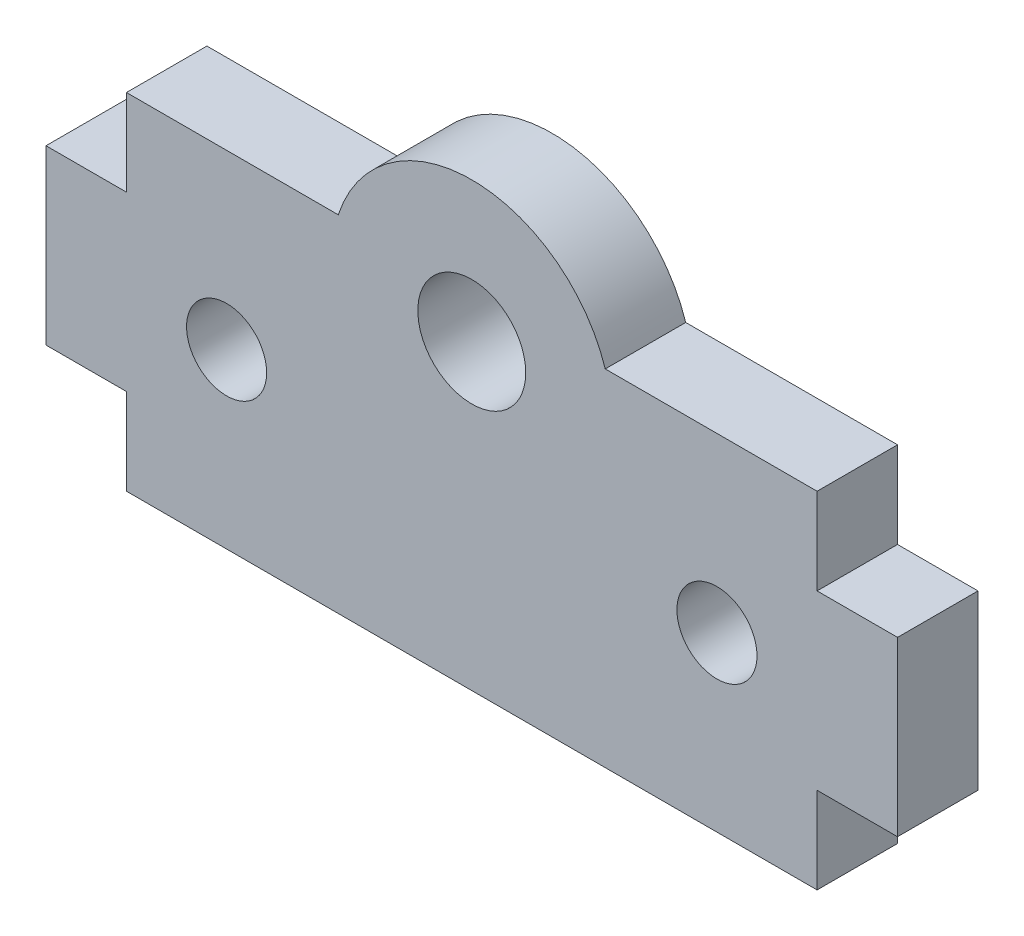
ISO-10303-21;
HEADER;
FILE_DESCRIPTION(('STEP AP214'),'2;1');
FILE_NAME('part.step','',(''),(''),'','','');
FILE_SCHEMA(('AUTOMOTIVE_DESIGN { 1 0 10303 214 1 1 1 1 }'));
ENDSEC;
DATA;
#1=APPLICATION_CONTEXT('core data for automotive mechanical design processes');
#2=APPLICATION_PROTOCOL_DEFINITION('international standard','automotive_design',2000,#1);
#3=PRODUCT_CONTEXT('',#1,'mechanical');
#4=PRODUCT('Part','Part','',(#3));
#5=PRODUCT_RELATED_PRODUCT_CATEGORY('part','',(#4));
#6=PRODUCT_DEFINITION_FORMATION('','',#4);
#7=PRODUCT_DEFINITION_CONTEXT('part definition',#1,'design');
#8=PRODUCT_DEFINITION('design','',#6,#7);
#9=PRODUCT_DEFINITION_SHAPE('','',#8);
#10=(LENGTH_UNIT() NAMED_UNIT(*) SI_UNIT(.MILLI.,.METRE.));
#11=(NAMED_UNIT(*) PLANE_ANGLE_UNIT() SI_UNIT($,.RADIAN.));
#12=(NAMED_UNIT(*) SI_UNIT($,.STERADIAN.) SOLID_ANGLE_UNIT());
#13=UNCERTAINTY_MEASURE_WITH_UNIT(LENGTH_MEASURE(1.E-05),#10,'distance_accuracy_value','');
#14=(GEOMETRIC_REPRESENTATION_CONTEXT(3) GLOBAL_UNCERTAINTY_ASSIGNED_CONTEXT((#13)) GLOBAL_UNIT_ASSIGNED_CONTEXT((#10,
#11,#12)) REPRESENTATION_CONTEXT('',''));
#15=CARTESIAN_POINT('',(0.,0.,0.));
#16=DIRECTION('',(0.,0.,1.));
#17=DIRECTION('',(1.,0.,0.));
#18=AXIS2_PLACEMENT_3D('',#15,#16,#17);
#19=CARTESIAN_POINT('',(0.,1.5875,1.47955));
#20=DIRECTION('',(0.,1.,0.));
#21=DIRECTION('',(-1.,0.,0.));
#22=AXIS2_PLACEMENT_3D('',#19,#20,#21);
#23=PLANE('',#22);
#24=DIRECTION('',(1.,0.,0.));
#25=VECTOR('',#24,1.);
#26=CARTESIAN_POINT('',(0.,1.5875,-1.47955));
#27=LINE('',#26,#25);
#28=CARTESIAN_POINT('',(4.90907263550103,1.5875,-1.47955));
#29=VERTEX_POINT('',#28);
#30=CARTESIAN_POINT('',(12.7,1.5875,-1.47955));
#31=VERTEX_POINT('',#30);
#32=EDGE_CURVE('E170',#29,#31,#27,.T.);
#33=ORIENTED_EDGE('',*,*,#32,.F.);
#34=DIRECTION('',(0.,0.,-1.));
#35=VECTOR('',#34,1.);
#36=CARTESIAN_POINT('',(4.90907263550103,1.5875,1.47955));
#37=LINE('',#36,#35);
#38=CARTESIAN_POINT('',(4.90907263550103,1.5875,1.47955));
#39=VERTEX_POINT('',#38);
#40=EDGE_CURVE('E11',#39,#29,#37,.T.);
#41=ORIENTED_EDGE('',*,*,#40,.F.);
#42=DIRECTION('',(1.,0.,0.));
#43=VECTOR('',#42,1.);
#44=CARTESIAN_POINT('',(0.,1.5875,1.47955));
#45=LINE('',#44,#43);
#46=CARTESIAN_POINT('',(12.7,1.5875,1.47955));
#47=VERTEX_POINT('',#46);
#48=EDGE_CURVE('E249',#39,#47,#45,.T.);
#49=ORIENTED_EDGE('',*,*,#48,.T.);
#50=DIRECTION('',(0.,0.,-1.));
#51=VECTOR('',#50,1.);
#52=CARTESIAN_POINT('',(12.7,1.5875,1.47955));
#53=LINE('',#52,#51);
#54=EDGE_CURVE('E54',#47,#31,#53,.T.);
#55=ORIENTED_EDGE('',*,*,#54,.T.);
#56=EDGE_LOOP('',(#33,#41,#49,#55));
#57=FACE_BOUND('',#56,.T.);
#58=ADVANCED_FACE('F35',(#57),#23,.T.);
#59=CARTESIAN_POINT('',(0.,0.,1.47955));
#60=DIRECTION('',(0.,0.,-1.));
#61=DIRECTION('',(-1.,0.,0.));
#62=AXIS2_PLACEMENT_3D('',#59,#60,#61);
#63=CYLINDRICAL_SURFACE('',#62,5.159375);
#64=CARTESIAN_POINT('',(0.,0.,-1.47955));
#65=DIRECTION('',(0.,0.,1.));
#66=DIRECTION('',(1.,0.,0.));
#67=AXIS2_PLACEMENT_3D('',#64,#65,#66);
#68=CIRCLE('',#67,5.159375);
#69=CARTESIAN_POINT('',(-4.90907263550103,1.5875,-1.47955));
#70=VERTEX_POINT('',#69);
#71=EDGE_CURVE('E173',#29,#70,#68,.T.);
#72=ORIENTED_EDGE('',*,*,#71,.T.);
#73=DIRECTION('',(0.,0.,-1.));
#74=VECTOR('',#73,1.);
#75=CARTESIAN_POINT('',(-4.90907263550103,1.5875,1.47955));
#76=LINE('',#75,#74);
#77=CARTESIAN_POINT('',(-4.90907263550103,1.5875,1.47955));
#78=VERTEX_POINT('',#77);
#79=EDGE_CURVE('E45',#78,#70,#76,.T.);
#80=ORIENTED_EDGE('',*,*,#79,.F.);
#81=CARTESIAN_POINT('',(0.,0.,1.47955));
#82=DIRECTION('',(0.,0.,1.));
#83=DIRECTION('',(1.,0.,0.));
#84=AXIS2_PLACEMENT_3D('',#81,#82,#83);
#85=CIRCLE('',#84,5.159375);
#86=EDGE_CURVE('E251',#39,#78,#85,.T.);
#87=ORIENTED_EDGE('',*,*,#86,.F.);
#88=ORIENTED_EDGE('',*,*,#40,.T.);
#89=EDGE_LOOP('',(#72,#80,#87,#88));
#90=FACE_BOUND('',#89,.T.);
#91=ADVANCED_FACE('F299',(#90),#63,.T.);
#92=CARTESIAN_POINT('',(0.,1.5875,1.47955));
#93=DIRECTION('',(0.,-1.,0.));
#94=DIRECTION('',(1.,0.,0.));
#95=AXIS2_PLACEMENT_3D('',#92,#93,#94);
#96=PLANE('',#95);
#97=DIRECTION('',(-1.,0.,0.));
#98=VECTOR('',#97,1.);
#99=CARTESIAN_POINT('',(0.,1.5875,-1.47955));
#100=LINE('',#99,#98);
#101=CARTESIAN_POINT('',(-12.7,1.5875,-1.47955));
#102=VERTEX_POINT('',#101);
#103=EDGE_CURVE('E176',#70,#102,#100,.T.);
#104=ORIENTED_EDGE('',*,*,#103,.T.);
#105=DIRECTION('',(0.,0.,-1.));
#106=VECTOR('',#105,1.);
#107=CARTESIAN_POINT('',(-12.7,1.5875,1.47955));
#108=LINE('',#107,#106);
#109=CARTESIAN_POINT('',(-12.7,1.5875,1.47955));
#110=VERTEX_POINT('',#109);
#111=EDGE_CURVE('E231',#110,#102,#108,.T.);
#112=ORIENTED_EDGE('',*,*,#111,.F.);
#113=DIRECTION('',(-1.,0.,0.));
#114=VECTOR('',#113,1.);
#115=CARTESIAN_POINT('',(0.,1.5875,1.47955));
#116=LINE('',#115,#114);
#117=EDGE_CURVE('E254',#78,#110,#116,.T.);
#118=ORIENTED_EDGE('',*,*,#117,.F.);
#119=ORIENTED_EDGE('',*,*,#79,.T.);
#120=EDGE_LOOP('',(#104,#112,#118,#119));
#121=FACE_BOUND('',#120,.T.);
#122=ADVANCED_FACE('F303',(#121),#96,.F.);
#123=CARTESIAN_POINT('',(-12.7,0.,1.47955));
#124=DIRECTION('',(1.,0.,0.));
#125=DIRECTION('',(0.,0.,-1.));
#126=AXIS2_PLACEMENT_3D('',#123,#124,#125);
#127=PLANE('',#126);
#128=DIRECTION('',(0.,-1.,0.));
#129=VECTOR('',#128,1.);
#130=CARTESIAN_POINT('',(-12.7,0.,-1.47955));
#131=LINE('',#130,#129);
#132=CARTESIAN_POINT('',(-12.7,-1.5875,-1.47955));
#133=VERTEX_POINT('',#132);
#134=EDGE_CURVE('E179',#102,#133,#131,.T.);
#135=ORIENTED_EDGE('',*,*,#134,.T.);
#136=DIRECTION('',(0.,0.,-1.));
#137=VECTOR('',#136,1.);
#138=CARTESIAN_POINT('',(-12.7,-1.5875,1.47955));
#139=LINE('',#138,#137);
#140=CARTESIAN_POINT('',(-12.7,-1.5875,1.47955));
#141=VERTEX_POINT('',#140);
#142=EDGE_CURVE('E228',#141,#133,#139,.T.);
#143=ORIENTED_EDGE('',*,*,#142,.F.);
#144=DIRECTION('',(0.,-1.,0.));
#145=VECTOR('',#144,1.);
#146=CARTESIAN_POINT('',(-12.7,0.,1.47955));
#147=LINE('',#146,#145);
#148=EDGE_CURVE('E257',#110,#141,#147,.T.);
#149=ORIENTED_EDGE('',*,*,#148,.F.);
#150=ORIENTED_EDGE('',*,*,#111,.T.);
#151=EDGE_LOOP('',(#135,#143,#149,#150));
#152=FACE_BOUND('',#151,.T.);
#153=ADVANCED_FACE('F309',(#152),#127,.F.);
#154=CARTESIAN_POINT('',(0.,-1.5875,1.47955));
#155=DIRECTION('',(0.,-1.,0.));
#156=DIRECTION('',(1.,0.,0.));
#157=AXIS2_PLACEMENT_3D('',#154,#155,#156);
#158=PLANE('',#157);
#159=DIRECTION('',(-1.,0.,0.));
#160=VECTOR('',#159,1.);
#161=CARTESIAN_POINT('',(0.,-1.5875,-1.47955));
#162=LINE('',#161,#160);
#163=CARTESIAN_POINT('',(-15.6591,-1.5875,-1.47955));
#164=VERTEX_POINT('',#163);
#165=EDGE_CURVE('E182',#133,#164,#162,.T.);
#166=ORIENTED_EDGE('',*,*,#165,.T.);
#167=DIRECTION('',(0.,0.,-1.));
#168=VECTOR('',#167,1.);
#169=CARTESIAN_POINT('',(-15.6591,-1.5875,1.47955));
#170=LINE('',#169,#168);
#171=CARTESIAN_POINT('',(-15.6591,-1.5875,1.47955));
#172=VERTEX_POINT('',#171);
#173=EDGE_CURVE('E225',#172,#164,#170,.T.);
#174=ORIENTED_EDGE('',*,*,#173,.F.);
#175=DIRECTION('',(-1.,0.,0.));
#176=VECTOR('',#175,1.);
#177=CARTESIAN_POINT('',(0.,-1.5875,1.47955));
#178=LINE('',#177,#176);
#179=EDGE_CURVE('E260',#141,#172,#178,.T.);
#180=ORIENTED_EDGE('',*,*,#179,.F.);
#181=ORIENTED_EDGE('',*,*,#142,.T.);
#182=EDGE_LOOP('',(#166,#174,#180,#181));
#183=FACE_BOUND('',#182,.T.);
#184=ADVANCED_FACE('F313',(#183),#158,.F.);
#185=CARTESIAN_POINT('',(-15.6591,0.,1.47955));
#186=DIRECTION('',(1.,0.,0.));
#187=DIRECTION('',(0.,0.,-1.));
#188=AXIS2_PLACEMENT_3D('',#185,#186,#187);
#189=PLANE('',#188);
#190=DIRECTION('',(0.,-1.,0.));
#191=VECTOR('',#190,1.);
#192=CARTESIAN_POINT('',(-15.6591,0.,-1.47955));
#193=LINE('',#192,#191);
#194=CARTESIAN_POINT('',(-15.6591,-7.9375,-1.47955));
#195=VERTEX_POINT('',#194);
#196=EDGE_CURVE('E185',#164,#195,#193,.T.);
#197=ORIENTED_EDGE('',*,*,#196,.T.);
#198=DIRECTION('',(0.,0.,-1.));
#199=VECTOR('',#198,1.);
#200=CARTESIAN_POINT('',(-15.6591,-7.9375,1.47955));
#201=LINE('',#200,#199);
#202=CARTESIAN_POINT('',(-15.6591,-7.9375,1.47955));
#203=VERTEX_POINT('',#202);
#204=EDGE_CURVE('E223',#203,#195,#201,.T.);
#205=ORIENTED_EDGE('',*,*,#204,.F.);
#206=DIRECTION('',(0.,-1.,0.));
#207=VECTOR('',#206,1.);
#208=CARTESIAN_POINT('',(-15.6591,0.,1.47955));
#209=LINE('',#208,#207);
#210=EDGE_CURVE('E263',#172,#203,#209,.T.);
#211=ORIENTED_EDGE('',*,*,#210,.F.);
#212=ORIENTED_EDGE('',*,*,#173,.T.);
#213=EDGE_LOOP('',(#197,#205,#211,#212));
#214=FACE_BOUND('',#213,.T.);
#215=ADVANCED_FACE('F317',(#214),#189,.F.);
#216=CARTESIAN_POINT('',(0.,-7.93750000000001,1.47955));
#217=DIRECTION('',(0.,-1.,0.));
#218=DIRECTION('',(1.,0.,0.));
#219=AXIS2_PLACEMENT_3D('',#216,#217,#218);
#220=PLANE('',#219);
#221=DIRECTION('',(-1.,0.,0.));
#222=VECTOR('',#221,1.);
#223=CARTESIAN_POINT('',(0.,-7.93750000000001,-1.47955));
#224=LINE('',#223,#222);
#225=CARTESIAN_POINT('',(-12.7,-7.9375,-1.47955));
#226=VERTEX_POINT('',#225);
#227=EDGE_CURVE('E188',#226,#195,#224,.T.);
#228=ORIENTED_EDGE('',*,*,#227,.F.);
#229=DIRECTION('',(0.,0.,-1.));
#230=VECTOR('',#229,1.);
#231=CARTESIAN_POINT('',(-12.7,-7.9375,1.47955));
#232=LINE('',#231,#230);
#233=CARTESIAN_POINT('',(-12.7,-7.9375,1.47955));
#234=VERTEX_POINT('',#233);
#235=EDGE_CURVE('E221',#234,#226,#232,.T.);
#236=ORIENTED_EDGE('',*,*,#235,.F.);
#237=DIRECTION('',(-1.,0.,0.));
#238=VECTOR('',#237,1.);
#239=CARTESIAN_POINT('',(0.,-7.93750000000001,1.47955));
#240=LINE('',#239,#238);
#241=EDGE_CURVE('E265',#234,#203,#240,.T.);
#242=ORIENTED_EDGE('',*,*,#241,.T.);
#243=ORIENTED_EDGE('',*,*,#204,.T.);
#244=EDGE_LOOP('',(#228,#236,#242,#243));
#245=FACE_BOUND('',#244,.T.);
#246=ADVANCED_FACE('F321',(#245),#220,.T.);
#247=CARTESIAN_POINT('',(-12.7,0.,1.47955));
#248=DIRECTION('',(-1.,0.,0.));
#249=DIRECTION('',(0.,0.,1.));
#250=AXIS2_PLACEMENT_3D('',#247,#248,#249);
#251=PLANE('',#250);
#252=DIRECTION('',(0.,1.,0.));
#253=VECTOR('',#252,1.);
#254=CARTESIAN_POINT('',(-12.7,0.,-1.47955));
#255=LINE('',#254,#253);
#256=CARTESIAN_POINT('',(-12.7,-11.1125,-1.47955));
#257=VERTEX_POINT('',#256);
#258=EDGE_CURVE('E191',#257,#226,#255,.T.);
#259=ORIENTED_EDGE('',*,*,#258,.F.);
#260=DIRECTION('',(0.,0.,-1.));
#261=VECTOR('',#260,1.);
#262=CARTESIAN_POINT('',(-12.7,-11.1125,1.47955));
#263=LINE('',#262,#261);
#264=CARTESIAN_POINT('',(-12.7,-11.1125,1.47955));
#265=VERTEX_POINT('',#264);
#266=EDGE_CURVE('E219',#265,#257,#263,.T.);
#267=ORIENTED_EDGE('',*,*,#266,.F.);
#268=DIRECTION('',(0.,1.,0.));
#269=VECTOR('',#268,1.);
#270=CARTESIAN_POINT('',(-12.7,0.,1.47955));
#271=LINE('',#270,#269);
#272=EDGE_CURVE('E268',#265,#234,#271,.T.);
#273=ORIENTED_EDGE('',*,*,#272,.T.);
#274=ORIENTED_EDGE('',*,*,#235,.T.);
#275=EDGE_LOOP('',(#259,#267,#273,#274));
#276=FACE_BOUND('',#275,.T.);
#277=ADVANCED_FACE('F325',(#276),#251,.T.);
#278=CARTESIAN_POINT('',(0.,-11.1125,1.47955));
#279=DIRECTION('',(0.,1.,0.));
#280=DIRECTION('',(-1.,0.,0.));
#281=AXIS2_PLACEMENT_3D('',#278,#279,#280);
#282=PLANE('',#281);
#283=DIRECTION('',(1.,0.,0.));
#284=VECTOR('',#283,1.);
#285=CARTESIAN_POINT('',(0.,-11.1125,-1.47955));
#286=LINE('',#285,#284);
#287=CARTESIAN_POINT('',(12.7,-11.1125,-1.47955));
#288=VERTEX_POINT('',#287);
#289=EDGE_CURVE('E194',#257,#288,#286,.T.);
#290=ORIENTED_EDGE('',*,*,#289,.T.);
#291=DIRECTION('',(0.,0.,-1.));
#292=VECTOR('',#291,1.);
#293=CARTESIAN_POINT('',(12.7,-11.1125,1.47955));
#294=LINE('',#293,#292);
#295=CARTESIAN_POINT('',(12.7,-11.1125,1.47955));
#296=VERTEX_POINT('',#295);
#297=EDGE_CURVE('E216',#296,#288,#294,.T.);
#298=ORIENTED_EDGE('',*,*,#297,.F.);
#299=DIRECTION('',(1.,0.,0.));
#300=VECTOR('',#299,1.);
#301=CARTESIAN_POINT('',(0.,-11.1125,1.47955));
#302=LINE('',#301,#300);
#303=EDGE_CURVE('E271',#265,#296,#302,.T.);
#304=ORIENTED_EDGE('',*,*,#303,.F.);
#305=ORIENTED_EDGE('',*,*,#266,.T.);
#306=EDGE_LOOP('',(#290,#298,#304,#305));
#307=FACE_BOUND('',#306,.T.);
#308=ADVANCED_FACE('F329',(#307),#282,.F.);
#309=CARTESIAN_POINT('',(12.7,0.,1.47955));
#310=DIRECTION('',(-1.,0.,0.));
#311=DIRECTION('',(0.,-1.,0.));
#312=AXIS2_PLACEMENT_3D('',#309,#310,#311);
#313=PLANE('',#312);
#314=DIRECTION('',(0.,1.,0.));
#315=VECTOR('',#314,1.);
#316=CARTESIAN_POINT('',(12.7,0.,-1.47955));
#317=LINE('',#316,#315);
#318=CARTESIAN_POINT('',(12.7,-7.9375,-1.47955));
#319=VERTEX_POINT('',#318);
#320=EDGE_CURVE('E197',#288,#319,#317,.T.);
#321=ORIENTED_EDGE('',*,*,#320,.T.);
#322=DIRECTION('',(0.,0.,-1.));
#323=VECTOR('',#322,1.);
#324=CARTESIAN_POINT('',(12.7,-7.9375,1.47955));
#325=LINE('',#324,#323);
#326=CARTESIAN_POINT('',(12.7,-7.9375,1.47955));
#327=VERTEX_POINT('',#326);
#328=EDGE_CURVE('E213',#327,#319,#325,.T.);
#329=ORIENTED_EDGE('',*,*,#328,.F.);
#330=DIRECTION('',(0.,1.,0.));
#331=VECTOR('',#330,1.);
#332=CARTESIAN_POINT('',(12.7,0.,1.47955));
#333=LINE('',#332,#331);
#334=EDGE_CURVE('E274',#296,#327,#333,.T.);
#335=ORIENTED_EDGE('',*,*,#334,.F.);
#336=ORIENTED_EDGE('',*,*,#297,.T.);
#337=EDGE_LOOP('',(#321,#329,#335,#336));
#338=FACE_BOUND('',#337,.T.);
#339=ADVANCED_FACE('F280',(#338),#313,.F.);
#340=CARTESIAN_POINT('',(0.,-7.9375,1.47955));
#341=DIRECTION('',(0.,1.,0.));
#342=DIRECTION('',(-1.,0.,0.));
#343=AXIS2_PLACEMENT_3D('',#340,#341,#342);
#344=PLANE('',#343);
#345=DIRECTION('',(1.,0.,0.));
#346=VECTOR('',#345,1.);
#347=CARTESIAN_POINT('',(0.,-7.9375,-1.47955));
#348=LINE('',#347,#346);
#349=CARTESIAN_POINT('',(15.6591,-7.93749999999999,-1.47955));
#350=VERTEX_POINT('',#349);
#351=EDGE_CURVE('E200',#319,#350,#348,.T.);
#352=ORIENTED_EDGE('',*,*,#351,.T.);
#353=DIRECTION('',(0.,0.,-1.));
#354=VECTOR('',#353,1.);
#355=CARTESIAN_POINT('',(15.6591,-7.93749999999999,1.47955));
#356=LINE('',#355,#354);
#357=CARTESIAN_POINT('',(15.6591,-7.93749999999999,1.47955));
#358=VERTEX_POINT('',#357);
#359=EDGE_CURVE('E149',#358,#350,#356,.T.);
#360=ORIENTED_EDGE('',*,*,#359,.F.);
#361=DIRECTION('',(1.,0.,0.));
#362=VECTOR('',#361,1.);
#363=CARTESIAN_POINT('',(0.,-7.9375,1.47955));
#364=LINE('',#363,#362);
#365=EDGE_CURVE('E158',#327,#358,#364,.T.);
#366=ORIENTED_EDGE('',*,*,#365,.F.);
#367=ORIENTED_EDGE('',*,*,#328,.T.);
#368=EDGE_LOOP('',(#352,#360,#366,#367));
#369=FACE_BOUND('',#368,.T.);
#370=ADVANCED_FACE('F282',(#369),#344,.F.);
#371=CARTESIAN_POINT('',(15.6591,0.,1.47955));
#372=DIRECTION('',(1.,0.,0.));
#373=DIRECTION('',(0.,0.,-1.));
#374=AXIS2_PLACEMENT_3D('',#371,#372,#373);
#375=PLANE('',#374);
#376=DIRECTION('',(0.,-1.,0.));
#377=VECTOR('',#376,1.);
#378=CARTESIAN_POINT('',(15.6591,0.,-1.47955));
#379=LINE('',#378,#377);
#380=CARTESIAN_POINT('',(15.6591,-1.58750000000001,-1.47955));
#381=VERTEX_POINT('',#380);
#382=EDGE_CURVE('E145',#381,#350,#379,.T.);
#383=ORIENTED_EDGE('',*,*,#382,.F.);
#384=DIRECTION('',(0.,0.,-1.));
#385=VECTOR('',#384,1.);
#386=CARTESIAN_POINT('',(15.6591,-1.58750000000001,1.47955));
#387=LINE('',#386,#385);
#388=CARTESIAN_POINT('',(15.6591,-1.58750000000001,1.47955));
#389=VERTEX_POINT('',#388);
#390=EDGE_CURVE('E140',#389,#381,#387,.T.);
#391=ORIENTED_EDGE('',*,*,#390,.F.);
#392=DIRECTION('',(0.,-1.,0.));
#393=VECTOR('',#392,1.);
#394=CARTESIAN_POINT('',(15.6591,0.,1.47955));
#395=LINE('',#394,#393);
#396=EDGE_CURVE('E143',#389,#358,#395,.T.);
#397=ORIENTED_EDGE('',*,*,#396,.T.);
#398=ORIENTED_EDGE('',*,*,#359,.T.);
#399=EDGE_LOOP('',(#383,#391,#397,#398));
#400=FACE_BOUND('',#399,.T.);
#401=ADVANCED_FACE('F142',(#400),#375,.T.);
#402=CARTESIAN_POINT('',(0.,-1.5875,1.47955));
#403=DIRECTION('',(0.,1.,0.));
#404=DIRECTION('',(-1.,0.,0.));
#405=AXIS2_PLACEMENT_3D('',#402,#403,#404);
#406=PLANE('',#405);
#407=DIRECTION('',(1.,0.,0.));
#408=VECTOR('',#407,1.);
#409=CARTESIAN_POINT('',(0.,-1.5875,-1.47955));
#410=LINE('',#409,#408);
#411=CARTESIAN_POINT('',(12.7,-1.5875,-1.47955));
#412=VERTEX_POINT('',#411);
#413=EDGE_CURVE('E204',#412,#381,#410,.T.);
#414=ORIENTED_EDGE('',*,*,#413,.F.);
#415=DIRECTION('',(0.,0.,-1.));
#416=VECTOR('',#415,1.);
#417=CARTESIAN_POINT('',(12.7,-1.5875,1.47955));
#418=LINE('',#417,#416);
#419=CARTESIAN_POINT('',(12.7,-1.5875,1.47955));
#420=VERTEX_POINT('',#419);
#421=EDGE_CURVE('E97',#420,#412,#418,.T.);
#422=ORIENTED_EDGE('',*,*,#421,.F.);
#423=DIRECTION('',(1.,0.,0.));
#424=VECTOR('',#423,1.);
#425=CARTESIAN_POINT('',(0.,-1.5875,1.47955));
#426=LINE('',#425,#424);
#427=EDGE_CURVE('E156',#420,#389,#426,.T.);
#428=ORIENTED_EDGE('',*,*,#427,.T.);
#429=ORIENTED_EDGE('',*,*,#390,.T.);
#430=EDGE_LOOP('',(#414,#422,#428,#429));
#431=FACE_BOUND('',#430,.T.);
#432=ADVANCED_FACE('F161',(#431),#406,.T.);
#433=CARTESIAN_POINT('',(0.,0.,1.47955));
#434=DIRECTION('',(0.,0.,-1.));
#435=DIRECTION('',(-1.,0.,0.));
#436=AXIS2_PLACEMENT_3D('',#433,#434,#435);
#437=CYLINDRICAL_SURFACE('',#436,1.984375);
#438=CARTESIAN_POINT('',(0.,0.,1.47955));
#439=DIRECTION('',(0.,0.,1.));
#440=DIRECTION('',(1.,0.,0.));
#441=AXIS2_PLACEMENT_3D('',#438,#439,#440);
#442=CIRCLE('',#441,1.984375);
#443=CARTESIAN_POINT('',(1.984375,0.,1.47955));
#444=VERTEX_POINT('',#443);
#445=EDGE_CURVE('E209',#444,#444,#442,.T.);
#446=ORIENTED_EDGE('',*,*,#445,.T.);
#447=EDGE_LOOP('',(#446));
#448=FACE_BOUND('',#447,.T.);
#449=CARTESIAN_POINT('',(0.,0.,-1.47955));
#450=DIRECTION('',(0.,0.,1.));
#451=DIRECTION('',(1.,0.,0.));
#452=AXIS2_PLACEMENT_3D('',#449,#450,#451);
#453=CIRCLE('',#452,1.984375);
#454=CARTESIAN_POINT('',(1.984375,0.,-1.47955));
#455=VERTEX_POINT('',#454);
#456=EDGE_CURVE('E167',#455,#455,#453,.T.);
#457=ORIENTED_EDGE('',*,*,#456,.F.);
#458=EDGE_LOOP('',(#457));
#459=FACE_BOUND('',#458,.T.);
#460=ADVANCED_FACE('F37',(#448,#459),#437,.F.);
#461=CARTESIAN_POINT('',(12.7,0.,1.47955));
#462=DIRECTION('',(1.,0.,0.));
#463=DIRECTION('',(0.,1.,0.));
#464=AXIS2_PLACEMENT_3D('',#461,#462,#463);
#465=PLANE('',#464);
#466=DIRECTION('',(0.,-1.,0.));
#467=VECTOR('',#466,1.);
#468=CARTESIAN_POINT('',(12.7,0.,-1.47955));
#469=LINE('',#468,#467);
#470=EDGE_CURVE('E206',#31,#412,#469,.T.);
#471=ORIENTED_EDGE('',*,*,#470,.F.);
#472=ORIENTED_EDGE('',*,*,#54,.F.);
#473=DIRECTION('',(0.,-1.,0.));
#474=VECTOR('',#473,1.);
#475=CARTESIAN_POINT('',(12.7,0.,1.47955));
#476=LINE('',#475,#474);
#477=EDGE_CURVE('E162',#47,#420,#476,.T.);
#478=ORIENTED_EDGE('',*,*,#477,.T.);
#479=ORIENTED_EDGE('',*,*,#421,.T.);
#480=EDGE_LOOP('',(#471,#472,#478,#479));
#481=FACE_BOUND('',#480,.T.);
#482=ADVANCED_FACE('F286',(#481),#465,.T.);
#483=CARTESIAN_POINT('',(0.,0.,1.47955));
#484=DIRECTION('',(0.,0.,1.));
#485=DIRECTION('',(1.,0.,0.));
#486=AXIS2_PLACEMENT_3D('',#483,#484,#485);
#487=PLANE('',#486);
#488=CARTESIAN_POINT('',(-9.017,-4.7625,1.47955));
#489=DIRECTION('',(0.,0.,1.));
#490=DIRECTION('',(1.,0.,0.));
#491=AXIS2_PLACEMENT_3D('',#488,#489,#490);
#492=CIRCLE('',#491,1.47319999999999);
#493=CARTESIAN_POINT('',(-7.54380000000001,-4.7625,1.47955));
#494=VERTEX_POINT('',#493);
#495=EDGE_CURVE('E244',#494,#494,#492,.T.);
#496=ORIENTED_EDGE('',*,*,#495,.F.);
#497=EDGE_LOOP('',(#496));
#498=FACE_BOUND('',#497,.T.);
#499=CARTESIAN_POINT('',(9.017,-4.7625,1.47955));
#500=DIRECTION('',(0.,0.,1.));
#501=DIRECTION('',(1.,0.,0.));
#502=AXIS2_PLACEMENT_3D('',#499,#500,#501);
#503=CIRCLE('',#502,1.47319999999999);
#504=CARTESIAN_POINT('',(10.4902,-4.7625,1.47955));
#505=VERTEX_POINT('',#504);
#506=EDGE_CURVE('E236',#505,#505,#503,.T.);
#507=ORIENTED_EDGE('',*,*,#506,.F.);
#508=EDGE_LOOP('',(#507));
#509=FACE_BOUND('',#508,.T.);
#510=ORIENTED_EDGE('',*,*,#445,.F.);
#511=EDGE_LOOP('',(#510));
#512=FACE_BOUND('',#511,.T.);
#513=ORIENTED_EDGE('',*,*,#48,.F.);
#514=ORIENTED_EDGE('',*,*,#86,.T.);
#515=ORIENTED_EDGE('',*,*,#117,.T.);
#516=ORIENTED_EDGE('',*,*,#148,.T.);
#517=ORIENTED_EDGE('',*,*,#179,.T.);
#518=ORIENTED_EDGE('',*,*,#210,.T.);
#519=ORIENTED_EDGE('',*,*,#241,.F.);
#520=ORIENTED_EDGE('',*,*,#272,.F.);
#521=ORIENTED_EDGE('',*,*,#303,.T.);
#522=ORIENTED_EDGE('',*,*,#334,.T.);
#523=ORIENTED_EDGE('',*,*,#365,.T.);
#524=ORIENTED_EDGE('',*,*,#396,.F.);
#525=ORIENTED_EDGE('',*,*,#427,.F.);
#526=ORIENTED_EDGE('',*,*,#477,.F.);
#527=EDGE_LOOP('',(#513,#514,#515,#516,#517,#518,#519,#520,#521,#522,#523,#524,#525,#526));
#528=FACE_BOUND('',#527,.T.);
#529=ADVANCED_FACE('F154',(#498,#509,#512,#528),#487,.T.);
#530=CARTESIAN_POINT('',(0.,0.,-1.47955));
#531=DIRECTION('',(0.,0.,1.));
#532=DIRECTION('',(1.,0.,0.));
#533=AXIS2_PLACEMENT_3D('',#530,#531,#532);
#534=PLANE('',#533);
#535=CARTESIAN_POINT('',(-9.017,-4.7625,-1.47955));
#536=DIRECTION('',(0.,0.,1.));
#537=DIRECTION('',(1.,0.,0.));
#538=AXIS2_PLACEMENT_3D('',#535,#536,#537);
#539=CIRCLE('',#538,1.47319999999999);
#540=CARTESIAN_POINT('',(-7.54380000000001,-4.7625,-1.47955));
#541=VERTEX_POINT('',#540);
#542=EDGE_CURVE('E39',#541,#541,#539,.T.);
#543=ORIENTED_EDGE('',*,*,#542,.T.);
#544=EDGE_LOOP('',(#543));
#545=FACE_BOUND('',#544,.T.);
#546=CARTESIAN_POINT('',(9.017,-4.7625,-1.47955));
#547=DIRECTION('',(0.,0.,1.));
#548=DIRECTION('',(1.,0.,0.));
#549=AXIS2_PLACEMENT_3D('',#546,#547,#548);
#550=CIRCLE('',#549,1.47319999999999);
#551=CARTESIAN_POINT('',(10.4902,-4.7625,-1.47955));
#552=VERTEX_POINT('',#551);
#553=EDGE_CURVE('E171',#552,#552,#550,.T.);
#554=ORIENTED_EDGE('',*,*,#553,.T.);
#555=EDGE_LOOP('',(#554));
#556=FACE_BOUND('',#555,.T.);
#557=ORIENTED_EDGE('',*,*,#456,.T.);
#558=EDGE_LOOP('',(#557));
#559=FACE_BOUND('',#558,.T.);
#560=ORIENTED_EDGE('',*,*,#32,.T.);
#561=ORIENTED_EDGE('',*,*,#470,.T.);
#562=ORIENTED_EDGE('',*,*,#413,.T.);
#563=ORIENTED_EDGE('',*,*,#382,.T.);
#564=ORIENTED_EDGE('',*,*,#351,.F.);
#565=ORIENTED_EDGE('',*,*,#320,.F.);
#566=ORIENTED_EDGE('',*,*,#289,.F.);
#567=ORIENTED_EDGE('',*,*,#258,.T.);
#568=ORIENTED_EDGE('',*,*,#227,.T.);
#569=ORIENTED_EDGE('',*,*,#196,.F.);
#570=ORIENTED_EDGE('',*,*,#165,.F.);
#571=ORIENTED_EDGE('',*,*,#134,.F.);
#572=ORIENTED_EDGE('',*,*,#103,.F.);
#573=ORIENTED_EDGE('',*,*,#71,.F.);
#574=EDGE_LOOP('',(#560,#561,#562,#563,#564,#565,#566,#567,#568,#569,#570,#571,#572,#573));
#575=FACE_BOUND('',#574,.T.);
#576=ADVANCED_FACE('F284',(#545,#556,#559,#575),#534,.F.);
#577=CARTESIAN_POINT('',(9.017,-4.7625,1.47955));
#578=DIRECTION('',(0.,0.,1.));
#579=DIRECTION('',(1.,0.,0.));
#580=AXIS2_PLACEMENT_3D('',#577,#578,#579);
#581=CYLINDRICAL_SURFACE('',#580,1.47319999999999);
#582=ORIENTED_EDGE('',*,*,#506,.T.);
#583=EDGE_LOOP('',(#582));
#584=FACE_BOUND('',#583,.T.);
#585=ORIENTED_EDGE('',*,*,#553,.F.);
#586=EDGE_LOOP('',(#585));
#587=FACE_BOUND('',#586,.T.);
#588=ADVANCED_FACE('F367',(#584,#587),#581,.F.);
#589=CARTESIAN_POINT('',(-9.017,-4.7625,1.47955));
#590=DIRECTION('',(0.,0.,1.));
#591=DIRECTION('',(1.,0.,0.));
#592=AXIS2_PLACEMENT_3D('',#589,#590,#591);
#593=CYLINDRICAL_SURFACE('',#592,1.47319999999999);
#594=ORIENTED_EDGE('',*,*,#495,.T.);
#595=EDGE_LOOP('',(#594));
#596=FACE_BOUND('',#595,.T.);
#597=ORIENTED_EDGE('',*,*,#542,.F.);
#598=EDGE_LOOP('',(#597));
#599=FACE_BOUND('',#598,.T.);
#600=ADVANCED_FACE('F376',(#596,#599),#593,.F.);
#601=CLOSED_SHELL('',(#58,#91,#122,#153,#184,#215,#246,#277,#308,#339,#370,#401,#432,#460,#482,
#529,#576,#588,#600));
#602=MANIFOLD_SOLID_BREP('B2',#601);
#603=ADVANCED_BREP_SHAPE_REPRESENTATION('',(#18,#602),#14);
#604=SHAPE_DEFINITION_REPRESENTATION(#9,#603);
ENDSEC;
END-ISO-10303-21;
